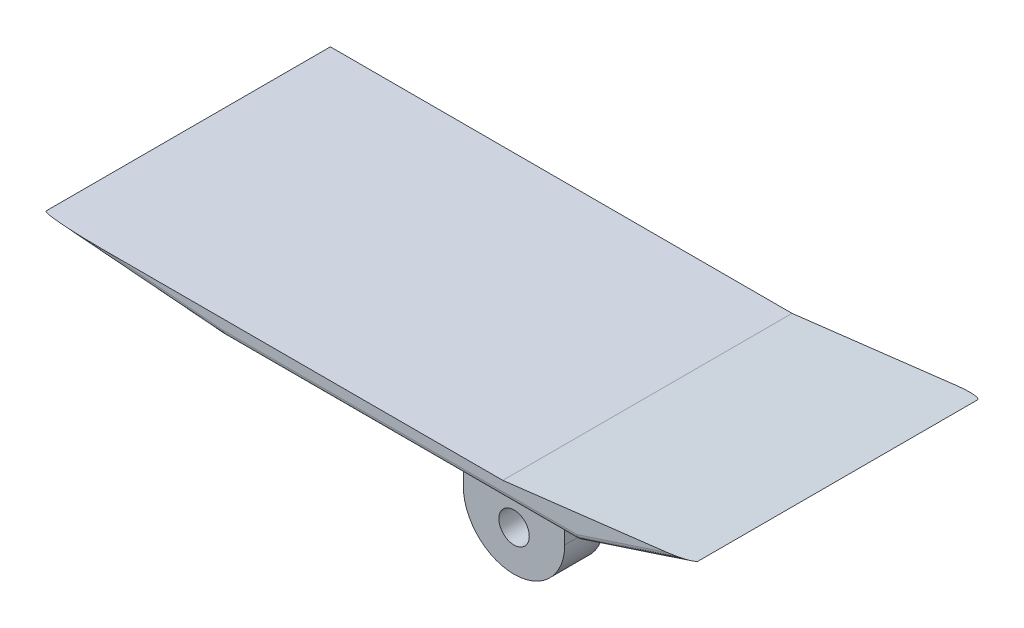
ISO-10303-21;
HEADER;
FILE_DESCRIPTION(('STEP AP214'),'2;1');
FILE_NAME('part.step','',(''),(''),'','','');
FILE_SCHEMA(('AUTOMOTIVE_DESIGN { 1 0 10303 214 1 1 1 1 }'));
ENDSEC;
DATA;
#1=APPLICATION_CONTEXT('core data for automotive mechanical design processes');
#2=APPLICATION_PROTOCOL_DEFINITION('international standard','automotive_design',2000,#1);
#3=PRODUCT_CONTEXT('',#1,'mechanical');
#4=PRODUCT('Part','Part','',(#3));
#5=PRODUCT_RELATED_PRODUCT_CATEGORY('part','',(#4));
#6=PRODUCT_DEFINITION_FORMATION('','',#4);
#7=PRODUCT_DEFINITION_CONTEXT('part definition',#1,'design');
#8=PRODUCT_DEFINITION('design','',#6,#7);
#9=PRODUCT_DEFINITION_SHAPE('','',#8);
#10=(LENGTH_UNIT() NAMED_UNIT(*) SI_UNIT(.MILLI.,.METRE.));
#11=(NAMED_UNIT(*) PLANE_ANGLE_UNIT() SI_UNIT($,.RADIAN.));
#12=(NAMED_UNIT(*) SI_UNIT($,.STERADIAN.) SOLID_ANGLE_UNIT());
#13=UNCERTAINTY_MEASURE_WITH_UNIT(LENGTH_MEASURE(1.E-05),#10,'distance_accuracy_value','');
#14=(GEOMETRIC_REPRESENTATION_CONTEXT(3) GLOBAL_UNCERTAINTY_ASSIGNED_CONTEXT((#13)) GLOBAL_UNIT_ASSIGNED_CONTEXT((#10,
#11,#12)) REPRESENTATION_CONTEXT('',''));
#15=CARTESIAN_POINT('',(0.,0.,0.));
#16=DIRECTION('',(0.,0.,1.));
#17=DIRECTION('',(1.,0.,0.));
#18=AXIS2_PLACEMENT_3D('',#15,#16,#17);
#19=CARTESIAN_POINT('',(-1500.,-1340.26701012435,-168.105566683837));
#20=DIRECTION('',(0.,-1.,0.));
#21=DIRECTION('',(0.,0.,-1.));
#22=AXIS2_PLACEMENT_3D('',#19,#20,#21);
#23=PLANE('',#22);
#24=DIRECTION('',(0.,0.,-1.));
#25=VECTOR('',#24,1.);
#26=CARTESIAN_POINT('',(1992.02807752052,-1340.26701012435,-168.105566683835));
#27=LINE('',#26,#25);
#28=CARTESIAN_POINT('',(1992.02807752052,-1340.26701012435,-118.105566683837));
#29=VERTEX_POINT('',#28);
#30=CARTESIAN_POINT('',(1992.02807752052,-1340.26701012435,2635.20722599521));
#31=VERTEX_POINT('',#30);
#32=EDGE_CURVE('E296',#29,#31,#27,.F.);
#33=ORIENTED_EDGE('',*,*,#32,.T.);
#34=DIRECTION('',(1.,0.,0.));
#35=VECTOR('',#34,1.);
#36=CARTESIAN_POINT('',(-1500.,-1340.26701012435,2635.20722599521));
#37=LINE('',#36,#35);
#38=CARTESIAN_POINT('',(-1497.95145974499,-1340.26701012435,2635.20722599521));
#39=VERTEX_POINT('',#38);
#40=EDGE_CURVE('E300',#31,#39,#37,.F.);
#41=ORIENTED_EDGE('',*,*,#40,.T.);
#42=DIRECTION('',(0.,0.,-1.));
#43=VECTOR('',#42,1.);
#44=CARTESIAN_POINT('',(-1497.951459745,-1340.26701012435,-168.105566683837));
#45=LINE('',#44,#43);
#46=CARTESIAN_POINT('',(-1497.951459745,-1340.26701012435,-118.105566683837));
#47=VERTEX_POINT('',#46);
#48=EDGE_CURVE('E298',#39,#47,#45,.T.);
#49=ORIENTED_EDGE('',*,*,#48,.T.);
#50=DIRECTION('',(1.,0.,0.));
#51=VECTOR('',#50,1.);
#52=CARTESIAN_POINT('',(-1500.,-1340.26701012435,-118.105566683837));
#53=LINE('',#52,#51);
#54=EDGE_CURVE('E294',#47,#29,#53,.T.);
#55=ORIENTED_EDGE('',*,*,#54,.T.);
#56=EDGE_LOOP('',(#33,#41,#49,#55));
#57=FACE_BOUND('',#56,.T.);
#58=DIRECTION('',(0.,0.,-1.));
#59=VECTOR('',#58,1.);
#60=CARTESIAN_POINT('',(670.760339716888,-1340.26701012435,421.894433316163));
#61=LINE('',#60,#59);
#62=CARTESIAN_POINT('',(670.760339716888,-1340.26701012435,421.894433316163));
#63=VERTEX_POINT('',#62);
#64=CARTESIAN_POINT('',(670.760339716888,-1340.26701012435,31.8944333161629));
#65=VERTEX_POINT('',#64);
#66=EDGE_CURVE('E263',#63,#65,#61,.T.);
#67=ORIENTED_EDGE('',*,*,#66,.F.);
#68=DIRECTION('',(-1.,0.,0.));
#69=VECTOR('',#68,1.);
#70=CARTESIAN_POINT('',(0.,-1340.26701012435,421.894433316163));
#71=LINE('',#70,#69);
#72=CARTESIAN_POINT('',(1670.76033971689,-1340.26701012435,421.894433316163));
#73=VERTEX_POINT('',#72);
#74=EDGE_CURVE('E246',#73,#63,#71,.T.);
#75=ORIENTED_EDGE('',*,*,#74,.F.);
#76=DIRECTION('',(0.,0.,-1.));
#77=VECTOR('',#76,1.);
#78=CARTESIAN_POINT('',(1670.76033971689,-1340.26701012435,421.894433316163));
#79=LINE('',#78,#77);
#80=CARTESIAN_POINT('',(1670.76033971689,-1340.26701012435,31.8944333161629));
#81=VERTEX_POINT('',#80);
#82=EDGE_CURVE('E180',#73,#81,#79,.T.);
#83=ORIENTED_EDGE('',*,*,#82,.T.);
#84=DIRECTION('',(-1.,0.,0.));
#85=VECTOR('',#84,1.);
#86=CARTESIAN_POINT('',(0.,-1340.26701012435,31.8944333161629));
#87=LINE('',#86,#85);
#88=EDGE_CURVE('E238',#81,#65,#87,.T.);
#89=ORIENTED_EDGE('',*,*,#88,.T.);
#90=EDGE_LOOP('',(#67,#75,#83,#89));
#91=FACE_BOUND('',#90,.T.);
#92=DIRECTION('',(0.,0.,1.));
#93=VECTOR('',#92,1.);
#94=CARTESIAN_POINT('',(1670.76033971689,-1340.26701012435,2095.20722599521));
#95=LINE('',#94,#93);
#96=CARTESIAN_POINT('',(1670.76033971689,-1340.26701012435,2095.20722599521));
#97=VERTEX_POINT('',#96);
#98=CARTESIAN_POINT('',(1670.76033971689,-1340.26701012435,2485.20722599521));
#99=VERTEX_POINT('',#98);
#100=EDGE_CURVE('E228',#97,#99,#95,.T.);
#101=ORIENTED_EDGE('',*,*,#100,.F.);
#102=DIRECTION('',(1.,0.,0.));
#103=VECTOR('',#102,1.);
#104=CARTESIAN_POINT('',(0.,-1340.26701012435,2095.20722599521));
#105=LINE('',#104,#103);
#106=CARTESIAN_POINT('',(670.760339716888,-1340.26701012435,2095.20722599521));
#107=VERTEX_POINT('',#106);
#108=EDGE_CURVE('E209',#107,#97,#105,.T.);
#109=ORIENTED_EDGE('',*,*,#108,.F.);
#110=DIRECTION('',(0.,0.,1.));
#111=VECTOR('',#110,1.);
#112=CARTESIAN_POINT('',(670.760339716888,-1340.26701012435,2095.20722599521));
#113=LINE('',#112,#111);
#114=CARTESIAN_POINT('',(670.760339716888,-1340.26701012435,2485.20722599521));
#115=VERTEX_POINT('',#114);
#116=EDGE_CURVE('E225',#107,#115,#113,.T.);
#117=ORIENTED_EDGE('',*,*,#116,.T.);
#118=DIRECTION('',(1.,0.,0.));
#119=VECTOR('',#118,1.);
#120=CARTESIAN_POINT('',(0.,-1340.26701012435,2485.20722599521));
#121=LINE('',#120,#119);
#122=EDGE_CURVE('E201',#115,#99,#121,.T.);
#123=ORIENTED_EDGE('',*,*,#122,.T.);
#124=EDGE_LOOP('',(#101,#109,#117,#123));
#125=FACE_BOUND('',#124,.T.);
#126=ADVANCED_FACE('F41',(#57,#91,#125),#23,.T.);
#127=CARTESIAN_POINT('',(-1500.,-1340.26701012435,2685.20722599521));
#128=DIRECTION('',(0.,0.,1.));
#129=DIRECTION('',(1.,0.,0.));
#130=AXIS2_PLACEMENT_3D('',#127,#128,#129);
#131=PLANE('',#130);
#132=DIRECTION('',(1.,0.,0.));
#133=VECTOR('',#132,1.);
#134=CARTESIAN_POINT('',(-1500.,-1290.26701012435,2685.20722599521));
#135=LINE('',#134,#133);
#136=CARTESIAN_POINT('',(-1497.95145974499,-1290.26701012435,2685.20722599521));
#137=VERTEX_POINT('',#136);
#138=CARTESIAN_POINT('',(1992.02807752052,-1290.26701012435,2685.20722599521));
#139=VERTEX_POINT('',#138);
#140=EDGE_CURVE('E370',#137,#139,#135,.T.);
#141=ORIENTED_EDGE('',*,*,#140,.T.);
#142=DIRECTION('',(0.950419137802848,0.310971803381098,0.));
#143=VECTOR('',#142,1.);
#144=CARTESIAN_POINT('',(-1177.08647142573,-2327.18348961082,2685.20722599521));
#145=LINE('',#144,#143);
#146=CARTESIAN_POINT('',(2885.58549254005,-997.900043045437,2685.20722599521));
#147=VERTEX_POINT('',#146);
#148=EDGE_CURVE('E283',#139,#147,#145,.T.);
#149=ORIENTED_EDGE('',*,*,#148,.T.);
#150=DIRECTION('',(-0.992876838486922,-0.119145220618431,0.));
#151=VECTOR('',#150,1.);
#152=CARTESIAN_POINT('',(3139.49376696443,-967.431050114511,2685.20722599521));
#153=LINE('',#152,#151);
#154=CARTESIAN_POINT('',(1260.,-1192.97030215024,2685.20722599521));
#155=VERTEX_POINT('',#154);
#156=EDGE_CURVE('E190',#147,#155,#153,.T.);
#157=ORIENTED_EDGE('',*,*,#156,.T.);
#158=DIRECTION('',(1.,0.,0.));
#159=VECTOR('',#158,1.);
#160=CARTESIAN_POINT('',(-1500.,-1192.97030215024,2685.20722599521));
#161=LINE('',#160,#159);
#162=CARTESIAN_POINT('',(-2683.34902289123,-1192.97030215024,2685.20722599521));
#163=VERTEX_POINT('',#162);
#164=EDGE_CURVE('E179',#163,#155,#161,.T.);
#165=ORIENTED_EDGE('',*,*,#164,.F.);
#166=DIRECTION('',(0.99664841225711,-0.0818042929520311,0.));
#167=VECTOR('',#166,1.);
#168=CARTESIAN_POINT('',(-1495.9097853524,-1290.4345895115,2685.20722599521));
#169=LINE('',#168,#167);
#170=EDGE_CURVE('E270',#163,#137,#169,.T.);
#171=ORIENTED_EDGE('',*,*,#170,.T.);
#172=EDGE_LOOP('',(#141,#149,#157,#165,#171));
#173=FACE_BOUND('',#172,.T.);
#174=ADVANCED_FACE('F374',(#173),#131,.T.);
#175=CARTESIAN_POINT('',(-1500.,-1192.97030215024,2685.20722599521));
#176=DIRECTION('',(0.,1.,0.));
#177=DIRECTION('',(0.,0.,1.));
#178=AXIS2_PLACEMENT_3D('',#175,#176,#177);
#179=PLANE('',#178);
#180=DIRECTION('',(0.,0.,1.));
#181=VECTOR('',#180,1.);
#182=CARTESIAN_POINT('',(-3294.56388944254,-1192.97030215024,-168.105574004794));
#183=LINE('',#182,#181);
#184=CARTESIAN_POINT('',(-3294.56388944254,-1192.97030215024,-168.105574004794));
#185=VERTEX_POINT('',#184);
#186=CARTESIAN_POINT('',(-3294.56388944254,-1192.97030215024,2635.20722599521));
#187=VERTEX_POINT('',#186);
#188=EDGE_CURVE('E174',#185,#187,#183,.T.);
#189=ORIENTED_EDGE('',*,*,#188,.T.);
#190=CARTESIAN_POINT('',(-2683.34902289123,-1192.97030215024,2635.20722599521));
#191=DIRECTION('',(0.,1.,0.));
#192=DIRECTION('',(1.,0.,0.));
#193=AXIS2_PLACEMENT_3D('',#190,#191,#192);
#194=ELLIPSE('',#193,611.214866551311,50.);
#195=EDGE_CURVE('E307',#187,#163,#194,.T.);
#196=ORIENTED_EDGE('',*,*,#195,.T.);
#197=ORIENTED_EDGE('',*,*,#164,.T.);
#198=DIRECTION('',(0.,0.,1.));
#199=VECTOR('',#198,1.);
#200=CARTESIAN_POINT('',(1260.,-1192.97030215024,-168.105574004794));
#201=LINE('',#200,#199);
#202=CARTESIAN_POINT('',(1259.99999999996,-1192.97030215024,-168.105566683837));
#203=VERTEX_POINT('',#202);
#204=EDGE_CURVE('E177',#203,#155,#201,.T.);
#205=ORIENTED_EDGE('',*,*,#204,.F.);
#206=DIRECTION('',(1.,0.,0.));
#207=VECTOR('',#206,1.);
#208=CARTESIAN_POINT('',(-1500.,-1192.97030215024,-168.105566683837));
#209=LINE('',#208,#207);
#210=EDGE_CURVE('E171',#185,#203,#209,.T.);
#211=ORIENTED_EDGE('',*,*,#210,.F.);
#212=EDGE_LOOP('',(#189,#196,#197,#205,#211));
#213=FACE_BOUND('',#212,.T.);
#214=ADVANCED_FACE('F173',(#213),#179,.T.);
#215=CARTESIAN_POINT('',(-1500.,-1192.97030215024,-168.105566683837));
#216=DIRECTION('',(0.,0.,-1.));
#217=DIRECTION('',(-1.,0.,0.));
#218=AXIS2_PLACEMENT_3D('',#215,#216,#217);
#219=PLANE('',#218);
#220=DIRECTION('',(-0.992876838486922,-0.119145220618431,0.));
#221=VECTOR('',#220,1.);
#222=CARTESIAN_POINT('',(3139.49376696443,-967.431050114511,-168.105574004794));
#223=LINE('',#222,#221);
#224=CARTESIAN_POINT('',(2885.58549254005,-997.900043045436,-168.105574004794));
#225=VERTEX_POINT('',#224);
#226=EDGE_CURVE('E193',#225,#203,#223,.T.);
#227=ORIENTED_EDGE('',*,*,#226,.F.);
#228=DIRECTION('',(0.950419137802848,0.310971803381098,0.));
#229=VECTOR('',#228,1.);
#230=CARTESIAN_POINT('',(-1133.55240600189,-2312.93938793515,-168.105566683837));
#231=LINE('',#230,#229);
#232=CARTESIAN_POINT('',(1992.02807752052,-1290.26701012435,-168.105566683837));
#233=VERTEX_POINT('',#232);
#234=EDGE_CURVE('E11',#225,#233,#231,.F.);
#235=ORIENTED_EDGE('',*,*,#234,.T.);
#236=DIRECTION('',(1.,0.,0.));
#237=VECTOR('',#236,1.);
#238=CARTESIAN_POINT('',(-1500.,-1290.26701012435,-168.105566683837));
#239=LINE('',#238,#237);
#240=CARTESIAN_POINT('',(-2109.16632629631,-1290.26701012435,-168.105574004794));
#241=VERTEX_POINT('',#240);
#242=EDGE_CURVE('E50',#233,#241,#239,.F.);
#243=ORIENTED_EDGE('',*,*,#242,.T.);
#244=DIRECTION('',(0.99664841225711,-0.0818042929520311,0.));
#245=VECTOR('',#244,1.);
#246=CARTESIAN_POINT('',(-3294.56388944254,-1192.97030215024,-168.105574004794));
#247=LINE('',#246,#245);
#248=EDGE_CURVE('E184',#185,#241,#247,.T.);
#249=ORIENTED_EDGE('',*,*,#248,.F.);
#250=ORIENTED_EDGE('',*,*,#210,.T.);
#251=EDGE_LOOP('',(#227,#235,#243,#249,#250));
#252=FACE_BOUND('',#251,.T.);
#253=ADVANCED_FACE('F189',(#252),#219,.T.);
#254=CARTESIAN_POINT('',(1670.76033971689,1.23661106518949E-12,421.894433316163));
#255=DIRECTION('',(1.,0.,0.));
#256=DIRECTION('',(0.,1.,0.));
#257=AXIS2_PLACEMENT_3D('',#254,#255,#256);
#258=PLANE('',#257);
#259=DIRECTION('',(0.,-1.,0.));
#260=VECTOR('',#259,1.);
#261=CARTESIAN_POINT('',(1670.76033971689,1.23661106518949E-12,31.8944333161629));
#262=LINE('',#261,#260);
#263=CARTESIAN_POINT('',(1670.76033971689,-1640.26701012435,31.8944333161629));
#264=VERTEX_POINT('',#263);
#265=EDGE_CURVE('E252',#81,#264,#262,.T.);
#266=ORIENTED_EDGE('',*,*,#265,.F.);
#267=ORIENTED_EDGE('',*,*,#82,.F.);
#268=DIRECTION('',(0.,-1.,0.));
#269=VECTOR('',#268,1.);
#270=CARTESIAN_POINT('',(1670.76033971689,1.23661106518949E-12,421.894433316163));
#271=LINE('',#270,#269);
#272=CARTESIAN_POINT('',(1670.76033971689,-1640.26701012435,421.894433316163));
#273=VERTEX_POINT('',#272);
#274=EDGE_CURVE('E237',#73,#273,#271,.T.);
#275=ORIENTED_EDGE('',*,*,#274,.T.);
#276=DIRECTION('',(0.,0.,-1.));
#277=VECTOR('',#276,1.);
#278=CARTESIAN_POINT('',(1670.76033971689,-1640.26701012435,421.894433316163));
#279=LINE('',#278,#277);
#280=EDGE_CURVE('E249',#273,#264,#279,.T.);
#281=ORIENTED_EDGE('',*,*,#280,.T.);
#282=EDGE_LOOP('',(#266,#267,#275,#281));
#283=FACE_BOUND('',#282,.T.);
#284=ADVANCED_FACE('F589',(#283),#258,.T.);
#285=CARTESIAN_POINT('',(670.760339716889,-2.48231191053027E-13,421.894433316163));
#286=DIRECTION('',(1.,0.,0.));
#287=DIRECTION('',(0.,1.,0.));
#288=AXIS2_PLACEMENT_3D('',#285,#286,#287);
#289=PLANE('',#288);
#290=DIRECTION('',(0.,-1.,0.));
#291=VECTOR('',#290,1.);
#292=CARTESIAN_POINT('',(670.760339716889,-2.48231191053027E-13,31.8944333161629));
#293=LINE('',#292,#291);
#294=CARTESIAN_POINT('',(670.760339716888,-1640.26701012435,31.8944333161629));
#295=VERTEX_POINT('',#294);
#296=EDGE_CURVE('E258',#65,#295,#293,.T.);
#297=ORIENTED_EDGE('',*,*,#296,.T.);
#298=DIRECTION('',(0.,0.,-1.));
#299=VECTOR('',#298,1.);
#300=CARTESIAN_POINT('',(670.760339716888,-1640.26701012435,421.894433316163));
#301=LINE('',#300,#299);
#302=CARTESIAN_POINT('',(670.760339716888,-1640.26701012435,421.894433316163));
#303=VERTEX_POINT('',#302);
#304=EDGE_CURVE('E266',#303,#295,#301,.T.);
#305=ORIENTED_EDGE('',*,*,#304,.F.);
#306=DIRECTION('',(0.,-1.,0.));
#307=VECTOR('',#306,1.);
#308=CARTESIAN_POINT('',(670.760339716889,-2.48231191053027E-13,421.894433316163));
#309=LINE('',#308,#307);
#310=EDGE_CURVE('E244',#63,#303,#309,.T.);
#311=ORIENTED_EDGE('',*,*,#310,.F.);
#312=ORIENTED_EDGE('',*,*,#66,.T.);
#313=EDGE_LOOP('',(#297,#305,#311,#312));
#314=FACE_BOUND('',#313,.T.);
#315=ADVANCED_FACE('F580',(#314),#289,.F.);
#316=CARTESIAN_POINT('',(1170.76033971689,-1740.26701012435,421.894433316163));
#317=DIRECTION('',(0.,0.,-1.));
#318=DIRECTION('',(-1.,0.,0.));
#319=AXIS2_PLACEMENT_3D('',#316,#317,#318);
#320=CYLINDRICAL_SURFACE('',#319,150.);
#321=CARTESIAN_POINT('',(1170.76033971689,-1740.26701012435,421.894433316163));
#322=DIRECTION('',(0.,0.,-1.));
#323=DIRECTION('',(-1.,0.,0.));
#324=AXIS2_PLACEMENT_3D('',#321,#322,#323);
#325=CIRCLE('',#324,150.);
#326=CARTESIAN_POINT('',(1020.76033971689,-1740.26701012435,421.894433316163));
#327=VERTEX_POINT('',#326);
#328=EDGE_CURVE('E234',#327,#327,#325,.T.);
#329=ORIENTED_EDGE('',*,*,#328,.F.);
#330=EDGE_LOOP('',(#329));
#331=FACE_BOUND('',#330,.T.);
#332=CARTESIAN_POINT('',(1170.76033971689,-1740.26701012435,31.8944333161629));
#333=DIRECTION('',(0.,0.,-1.));
#334=DIRECTION('',(-1.,0.,0.));
#335=AXIS2_PLACEMENT_3D('',#332,#333,#334);
#336=CIRCLE('',#335,150.);
#337=CARTESIAN_POINT('',(1020.76033971689,-1740.26701012435,31.8944333161629));
#338=VERTEX_POINT('',#337);
#339=EDGE_CURVE('E227',#338,#338,#336,.T.);
#340=ORIENTED_EDGE('',*,*,#339,.T.);
#341=EDGE_LOOP('',(#340));
#342=FACE_BOUND('',#341,.T.);
#343=ADVANCED_FACE('F571',(#331,#342),#320,.F.);
#344=CARTESIAN_POINT('',(1170.76033971689,-1640.26701012435,421.894433316163));
#345=DIRECTION('',(0.,0.,-1.));
#346=DIRECTION('',(-1.,0.,0.));
#347=AXIS2_PLACEMENT_3D('',#344,#345,#346);
#348=CYLINDRICAL_SURFACE('',#347,500.);
#349=CARTESIAN_POINT('',(1170.76033971689,-1640.26701012435,31.8944333161629));
#350=DIRECTION('',(0.,0.,-1.));
#351=DIRECTION('',(-1.,0.,0.));
#352=AXIS2_PLACEMENT_3D('',#349,#350,#351);
#353=CIRCLE('',#352,500.);
#354=EDGE_CURVE('E255',#264,#295,#353,.T.);
#355=ORIENTED_EDGE('',*,*,#354,.F.);
#356=ORIENTED_EDGE('',*,*,#280,.F.);
#357=CARTESIAN_POINT('',(1170.76033971689,-1640.26701012435,421.894433316163));
#358=DIRECTION('',(0.,0.,-1.));
#359=DIRECTION('',(-1.,0.,0.));
#360=AXIS2_PLACEMENT_3D('',#357,#358,#359);
#361=CIRCLE('',#360,500.);
#362=EDGE_CURVE('E241',#273,#303,#361,.T.);
#363=ORIENTED_EDGE('',*,*,#362,.T.);
#364=ORIENTED_EDGE('',*,*,#304,.T.);
#365=EDGE_LOOP('',(#355,#356,#363,#364));
#366=FACE_BOUND('',#365,.T.);
#367=ADVANCED_FACE('F562',(#366),#348,.T.);
#368=CARTESIAN_POINT('',(0.,0.,421.894433316163));
#369=DIRECTION('',(0.,0.,-1.));
#370=DIRECTION('',(-1.,0.,0.));
#371=AXIS2_PLACEMENT_3D('',#368,#369,#370);
#372=PLANE('',#371);
#373=ORIENTED_EDGE('',*,*,#328,.T.);
#374=EDGE_LOOP('',(#373));
#375=FACE_BOUND('',#374,.T.);
#376=ORIENTED_EDGE('',*,*,#274,.F.);
#377=ORIENTED_EDGE('',*,*,#74,.T.);
#378=ORIENTED_EDGE('',*,*,#310,.T.);
#379=ORIENTED_EDGE('',*,*,#362,.F.);
#380=EDGE_LOOP('',(#376,#377,#378,#379));
#381=FACE_BOUND('',#380,.T.);
#382=ADVANCED_FACE('F553',(#375,#381),#372,.F.);
#383=CARTESIAN_POINT('',(0.,0.,31.8944333161629));
#384=DIRECTION('',(0.,0.,-1.));
#385=DIRECTION('',(-1.,0.,0.));
#386=AXIS2_PLACEMENT_3D('',#383,#384,#385);
#387=PLANE('',#386);
#388=ORIENTED_EDGE('',*,*,#339,.F.);
#389=EDGE_LOOP('',(#388));
#390=FACE_BOUND('',#389,.T.);
#391=ORIENTED_EDGE('',*,*,#265,.T.);
#392=ORIENTED_EDGE('',*,*,#354,.T.);
#393=ORIENTED_EDGE('',*,*,#296,.F.);
#394=ORIENTED_EDGE('',*,*,#88,.F.);
#395=EDGE_LOOP('',(#391,#392,#393,#394));
#396=FACE_BOUND('',#395,.T.);
#397=ADVANCED_FACE('F540',(#390,#396),#387,.T.);
#398=CARTESIAN_POINT('',(670.76033971689,-7.44693573159083E-13,2095.20722599521));
#399=DIRECTION('',(1.,0.,0.));
#400=DIRECTION('',(0.,1.,0.));
#401=AXIS2_PLACEMENT_3D('',#398,#399,#400);
#402=PLANE('',#401);
#403=DIRECTION('',(0.,1.,0.));
#404=VECTOR('',#403,1.);
#405=CARTESIAN_POINT('',(670.76033971689,-7.44693573159083E-13,2485.20722599521));
#406=LINE('',#405,#404);
#407=CARTESIAN_POINT('',(670.760339716888,-1640.26701012435,2485.20722599521));
#408=VERTEX_POINT('',#407);
#409=EDGE_CURVE('E215',#408,#115,#406,.T.);
#410=ORIENTED_EDGE('',*,*,#409,.T.);
#411=ORIENTED_EDGE('',*,*,#116,.F.);
#412=DIRECTION('',(0.,1.,0.));
#413=VECTOR('',#412,1.);
#414=CARTESIAN_POINT('',(670.76033971689,-7.44693573159083E-13,2095.20722599521));
#415=LINE('',#414,#413);
#416=CARTESIAN_POINT('',(670.760339716888,-1640.26701012435,2095.20722599521));
#417=VERTEX_POINT('',#416);
#418=EDGE_CURVE('E200',#417,#107,#415,.T.);
#419=ORIENTED_EDGE('',*,*,#418,.F.);
#420=DIRECTION('',(0.,0.,1.));
#421=VECTOR('',#420,1.);
#422=CARTESIAN_POINT('',(670.760339716888,-1640.26701012435,2095.20722599521));
#423=LINE('',#422,#421);
#424=EDGE_CURVE('E212',#417,#408,#423,.T.);
#425=ORIENTED_EDGE('',*,*,#424,.T.);
#426=EDGE_LOOP('',(#410,#411,#419,#425));
#427=FACE_BOUND('',#426,.T.);
#428=ADVANCED_FACE('F531',(#427),#402,.F.);
#429=CARTESIAN_POINT('',(1670.76033971689,2.47322213037898E-12,2095.20722599521));
#430=DIRECTION('',(-1.,0.,0.));
#431=DIRECTION('',(0.,-1.,0.));
#432=AXIS2_PLACEMENT_3D('',#429,#430,#431);
#433=PLANE('',#432);
#434=DIRECTION('',(0.,-1.,0.));
#435=VECTOR('',#434,1.);
#436=CARTESIAN_POINT('',(1670.76033971689,2.47322213037898E-12,2485.20722599521));
#437=LINE('',#436,#435);
#438=CARTESIAN_POINT('',(1670.76033971689,-1640.26701012435,2485.20722599521));
#439=VERTEX_POINT('',#438);
#440=EDGE_CURVE('E221',#99,#439,#437,.T.);
#441=ORIENTED_EDGE('',*,*,#440,.T.);
#442=DIRECTION('',(0.,0.,1.));
#443=VECTOR('',#442,1.);
#444=CARTESIAN_POINT('',(1670.76033971689,-1640.26701012435,2095.20722599521));
#445=LINE('',#444,#443);
#446=CARTESIAN_POINT('',(1670.76033971689,-1640.26701012435,2095.20722599521));
#447=VERTEX_POINT('',#446);
#448=EDGE_CURVE('E231',#447,#439,#445,.T.);
#449=ORIENTED_EDGE('',*,*,#448,.F.);
#450=DIRECTION('',(0.,-1.,0.));
#451=VECTOR('',#450,1.);
#452=CARTESIAN_POINT('',(1670.76033971689,2.47322213037898E-12,2095.20722599521));
#453=LINE('',#452,#451);
#454=EDGE_CURVE('E207',#97,#447,#453,.T.);
#455=ORIENTED_EDGE('',*,*,#454,.F.);
#456=ORIENTED_EDGE('',*,*,#100,.T.);
#457=EDGE_LOOP('',(#441,#449,#455,#456));
#458=FACE_BOUND('',#457,.T.);
#459=ADVANCED_FACE('F522',(#458),#433,.F.);
#460=CARTESIAN_POINT('',(1170.76033971689,-1740.26701012435,2095.20722599521));
#461=DIRECTION('',(0.,0.,1.));
#462=DIRECTION('',(1.,0.,0.));
#463=AXIS2_PLACEMENT_3D('',#460,#461,#462);
#464=CYLINDRICAL_SURFACE('',#463,150.);
#465=CARTESIAN_POINT('',(1170.76033971689,-1740.26701012435,2095.20722599521));
#466=DIRECTION('',(0.,0.,1.));
#467=DIRECTION('',(1.,0.,0.));
#468=AXIS2_PLACEMENT_3D('',#465,#466,#467);
#469=CIRCLE('',#468,150.);
#470=CARTESIAN_POINT('',(1320.76033971689,-1740.26701012435,2095.20722599521));
#471=VERTEX_POINT('',#470);
#472=EDGE_CURVE('E197',#471,#471,#469,.T.);
#473=ORIENTED_EDGE('',*,*,#472,.F.);
#474=EDGE_LOOP('',(#473));
#475=FACE_BOUND('',#474,.T.);
#476=CARTESIAN_POINT('',(1170.76033971689,-1740.26701012435,2485.20722599521));
#477=DIRECTION('',(0.,0.,1.));
#478=DIRECTION('',(1.,0.,0.));
#479=AXIS2_PLACEMENT_3D('',#476,#477,#478);
#480=CIRCLE('',#479,150.);
#481=CARTESIAN_POINT('',(1320.76033971689,-1740.26701012435,2485.20722599521));
#482=VERTEX_POINT('',#481);
#483=EDGE_CURVE('E187',#482,#482,#480,.T.);
#484=ORIENTED_EDGE('',*,*,#483,.T.);
#485=EDGE_LOOP('',(#484));
#486=FACE_BOUND('',#485,.T.);
#487=ADVANCED_FACE('F513',(#475,#486),#464,.F.);
#488=CARTESIAN_POINT('',(1170.76033971689,-1640.26701012435,2095.20722599521));
#489=DIRECTION('',(0.,0.,1.));
#490=DIRECTION('',(1.,0.,0.));
#491=AXIS2_PLACEMENT_3D('',#488,#489,#490);
#492=CYLINDRICAL_SURFACE('',#491,500.);
#493=CARTESIAN_POINT('',(1170.76033971689,-1640.26701012435,2485.20722599521));
#494=DIRECTION('',(0.,0.,1.));
#495=DIRECTION('',(1.,0.,0.));
#496=AXIS2_PLACEMENT_3D('',#493,#494,#495);
#497=CIRCLE('',#496,500.);
#498=EDGE_CURVE('E218',#408,#439,#497,.T.);
#499=ORIENTED_EDGE('',*,*,#498,.F.);
#500=ORIENTED_EDGE('',*,*,#424,.F.);
#501=CARTESIAN_POINT('',(1170.76033971689,-1640.26701012435,2095.20722599521));
#502=DIRECTION('',(0.,0.,1.));
#503=DIRECTION('',(1.,0.,0.));
#504=AXIS2_PLACEMENT_3D('',#501,#502,#503);
#505=CIRCLE('',#504,500.);
#506=EDGE_CURVE('E204',#417,#447,#505,.T.);
#507=ORIENTED_EDGE('',*,*,#506,.T.);
#508=ORIENTED_EDGE('',*,*,#448,.T.);
#509=EDGE_LOOP('',(#499,#500,#507,#508));
#510=FACE_BOUND('',#509,.T.);
#511=ADVANCED_FACE('F504',(#510),#492,.T.);
#512=CARTESIAN_POINT('',(0.,0.,2095.20722599521));
#513=DIRECTION('',(0.,0.,1.));
#514=DIRECTION('',(1.,0.,0.));
#515=AXIS2_PLACEMENT_3D('',#512,#513,#514);
#516=PLANE('',#515);
#517=ORIENTED_EDGE('',*,*,#472,.T.);
#518=EDGE_LOOP('',(#517));
#519=FACE_BOUND('',#518,.T.);
#520=ORIENTED_EDGE('',*,*,#418,.T.);
#521=ORIENTED_EDGE('',*,*,#108,.T.);
#522=ORIENTED_EDGE('',*,*,#454,.T.);
#523=ORIENTED_EDGE('',*,*,#506,.F.);
#524=EDGE_LOOP('',(#520,#521,#522,#523));
#525=FACE_BOUND('',#524,.T.);
#526=ADVANCED_FACE('F494',(#519,#525),#516,.F.);
#527=CARTESIAN_POINT('',(0.,0.,2485.20722599521));
#528=DIRECTION('',(0.,0.,1.));
#529=DIRECTION('',(1.,0.,0.));
#530=AXIS2_PLACEMENT_3D('',#527,#528,#529);
#531=PLANE('',#530);
#532=ORIENTED_EDGE('',*,*,#483,.F.);
#533=EDGE_LOOP('',(#532));
#534=FACE_BOUND('',#533,.T.);
#535=ORIENTED_EDGE('',*,*,#409,.F.);
#536=ORIENTED_EDGE('',*,*,#498,.T.);
#537=ORIENTED_EDGE('',*,*,#440,.F.);
#538=ORIENTED_EDGE('',*,*,#122,.F.);
#539=EDGE_LOOP('',(#535,#536,#537,#538));
#540=FACE_BOUND('',#539,.T.);
#541=ADVANCED_FACE('F486',(#534,#540),#531,.T.);
#542=CARTESIAN_POINT('',(-3294.56388944254,-1192.97030215024,-168.105574004794));
#543=DIRECTION('',(-0.0818042929520311,-0.99664841225711,0.));
#544=DIRECTION('',(0.99664841225711,-0.0818042929520311,0.));
#545=AXIS2_PLACEMENT_3D('',#542,#543,#544);
#546=PLANE('',#545);
#547=DIRECTION('',(0.,0.,-1.));
#548=VECTOR('',#547,1.);
#549=CARTESIAN_POINT('',(-1502.0416743926,-1340.09943073721,-168.105574004797));
#550=LINE('',#549,#548);
#551=CARTESIAN_POINT('',(-1502.0416743926,-1340.09943073721,-122.195781331438));
#552=VERTEX_POINT('',#551);
#553=CARTESIAN_POINT('',(-1502.0416743926,-1340.09943073721,2635.20722599521));
#554=VERTEX_POINT('',#553);
#555=EDGE_CURVE('E64',#552,#554,#550,.F.);
#556=ORIENTED_EDGE('',*,*,#555,.T.);
#557=DIRECTION('',(0.99664841225711,-0.0818042929520311,0.));
#558=VECTOR('',#557,1.);
#559=CARTESIAN_POINT('',(-3294.56388944254,-1192.97030215024,2635.20722599521));
#560=LINE('',#559,#558);
#561=EDGE_CURVE('E186',#554,#187,#560,.F.);
#562=ORIENTED_EDGE('',*,*,#561,.T.);
#563=ORIENTED_EDGE('',*,*,#188,.F.);
#564=ORIENTED_EDGE('',*,*,#248,.T.);
#565=CARTESIAN_POINT('',(-2109.16632629631,-1290.26701012435,-118.105566683837));
#566=DIRECTION('',(-0.0818042929520311,-0.99664841225711,0.));
#567=DIRECTION('',(0.99664841225711,-0.0818042929520311,0.));
#568=AXIS2_PLACEMENT_3D('',#565,#566,#567);
#569=ELLIPSE('',#568,611.214866551311,50.);
#570=EDGE_CURVE('E303',#241,#552,#569,.T.);
#571=ORIENTED_EDGE('',*,*,#570,.T.);
#572=EDGE_LOOP('',(#556,#562,#563,#564,#571));
#573=FACE_BOUND('',#572,.T.);
#574=ADVANCED_FACE('F183',(#573),#546,.T.);
#575=CARTESIAN_POINT('',(3139.49376696443,-967.431050114511,-168.105574004794));
#576=DIRECTION('',(-0.119145220618431,0.992876838486922,0.));
#577=DIRECTION('',(-0.992876838486922,-0.119145220618431,0.));
#578=AXIS2_PLACEMENT_3D('',#575,#576,#577);
#579=PLANE('',#578);
#580=ORIENTED_EDGE('',*,*,#156,.F.);
#581=CARTESIAN_POINT('',(2885.58549254005,-997.900043045436,2635.20722599521));
#582=DIRECTION('',(-0.119145220618431,0.992876838486922,0.));
#583=DIRECTION('',(0.992876838486922,0.119145220618431,0.));
#584=AXIS2_PLACEMENT_3D('',#581,#582,#583);
#585=ELLIPSE('',#584,255.729879660921,50.);
#586=CARTESIAN_POINT('',(3139.49376696443,-967.431050114511,2635.20722599521));
#587=VERTEX_POINT('',#586);
#588=EDGE_CURVE('E286',#147,#587,#585,.T.);
#589=ORIENTED_EDGE('',*,*,#588,.T.);
#590=DIRECTION('',(0.,0.,1.));
#591=VECTOR('',#590,1.);
#592=CARTESIAN_POINT('',(3139.49376696443,-967.431050114511,-168.105574004794));
#593=LINE('',#592,#591);
#594=CARTESIAN_POINT('',(3139.49376696443,-967.431050114511,-118.105566683837));
#595=VERTEX_POINT('',#594);
#596=EDGE_CURVE('E274',#595,#587,#593,.T.);
#597=ORIENTED_EDGE('',*,*,#596,.F.);
#598=CARTESIAN_POINT('',(2885.58549254005,-997.900043045436,-118.105566683837));
#599=DIRECTION('',(-0.119145220618431,0.992876838486922,0.));
#600=DIRECTION('',(0.992876838486922,0.119145220618431,0.));
#601=AXIS2_PLACEMENT_3D('',#598,#599,#600);
#602=ELLIPSE('',#601,255.729879660921,50.);
#603=EDGE_CURVE('E284',#595,#225,#602,.T.);
#604=ORIENTED_EDGE('',*,*,#603,.T.);
#605=ORIENTED_EDGE('',*,*,#226,.T.);
#606=ORIENTED_EDGE('',*,*,#204,.T.);
#607=EDGE_LOOP('',(#580,#589,#597,#604,#605,#606));
#608=FACE_BOUND('',#607,.T.);
#609=ADVANCED_FACE('F469',(#608),#579,.T.);
#610=CARTESIAN_POINT('',(2000.,-1340.26701012435,-168.105574004794));
#611=DIRECTION('',(0.310971803381098,-0.950419137802848,0.));
#612=DIRECTION('',(0.950419137802848,0.310971803381098,0.));
#613=AXIS2_PLACEMENT_3D('',#610,#611,#612);
#614=PLANE('',#613);
#615=ORIENTED_EDGE('',*,*,#596,.T.);
#616=DIRECTION('',(0.950419137802848,0.310971803381098,0.));
#617=VECTOR('',#616,1.);
#618=CARTESIAN_POINT('',(2000.,-1340.26701012435,2635.20722599521));
#619=LINE('',#618,#617);
#620=CARTESIAN_POINT('',(2007.57666768958,-1337.78796701449,2635.20722599521));
#621=VERTEX_POINT('',#620);
#622=EDGE_CURVE('E292',#587,#621,#619,.F.);
#623=ORIENTED_EDGE('',*,*,#622,.T.);
#624=DIRECTION('',(0.,0.,-1.));
#625=VECTOR('',#624,1.);
#626=CARTESIAN_POINT('',(2007.57666768958,-1337.78796701449,-168.105574004794));
#627=LINE('',#626,#625);
#628=CARTESIAN_POINT('',(2007.57666768958,-1337.78796701449,-118.105566683837));
#629=VERTEX_POINT('',#628);
#630=EDGE_CURVE('E290',#621,#629,#627,.T.);
#631=ORIENTED_EDGE('',*,*,#630,.T.);
#632=DIRECTION('',(0.950419137802848,0.310971803381098,0.));
#633=VECTOR('',#632,1.);
#634=CARTESIAN_POINT('',(2000.,-1340.26701012435,-118.105566683837));
#635=LINE('',#634,#633);
#636=EDGE_CURVE('E288',#629,#595,#635,.T.);
#637=ORIENTED_EDGE('',*,*,#636,.T.);
#638=EDGE_LOOP('',(#615,#623,#631,#637));
#639=FACE_BOUND('',#638,.T.);
#640=ADVANCED_FACE('F461',(#639),#614,.T.);
#641=CARTESIAN_POINT('',(1984.45140983095,-1292.74605323421,-118.105566683837));
#642=DIRECTION('',(0.950419137802848,0.310971803381098,0.));
#643=DIRECTION('',(-0.310971803381098,0.950419137802848,0.));
#644=AXIS2_PLACEMENT_3D('',#641,#642,#643);
#645=CYLINDRICAL_SURFACE('',#644,50.);
#646=ORIENTED_EDGE('',*,*,#603,.F.);
#647=ORIENTED_EDGE('',*,*,#636,.F.);
#648=CARTESIAN_POINT('',(1992.02807752052,-1290.26701012435,-118.105566683837));
#649=DIRECTION('',(-0.950419137802847,-0.310971803381101,0.));
#650=DIRECTION('',(0.310971803381101,-0.950419137802847,0.));
#651=AXIS2_PLACEMENT_3D('',#648,#649,#650);
#652=CIRCLE('',#651,50.);
#653=EDGE_CURVE('E332',#233,#629,#652,.T.);
#654=ORIENTED_EDGE('',*,*,#653,.F.);
#655=ORIENTED_EDGE('',*,*,#234,.F.);
#656=EDGE_LOOP('',(#646,#647,#654,#655));
#657=FACE_BOUND('',#656,.T.);
#658=ADVANCED_FACE('F43',(#657),#645,.T.);
#659=CARTESIAN_POINT('',(-1500.,-1290.26701012435,-118.105566683837));
#660=DIRECTION('',(1.,0.,0.));
#661=DIRECTION('',(0.,0.,-1.));
#662=AXIS2_PLACEMENT_3D('',#659,#660,#661);
#663=CYLINDRICAL_SURFACE('',#662,50.);
#664=CARTESIAN_POINT('',(1992.02807752052,-1290.26701012435,-118.105566683837));
#665=DIRECTION('',(1.,0.,0.));
#666=DIRECTION('',(0.,0.,-1.));
#667=AXIS2_PLACEMENT_3D('',#664,#665,#666);
#668=CIRCLE('',#667,50.);
#669=EDGE_CURVE('E330',#29,#233,#668,.T.);
#670=ORIENTED_EDGE('',*,*,#669,.F.);
#671=ORIENTED_EDGE('',*,*,#54,.F.);
#672=CARTESIAN_POINT('',(-1497.951459745,-1290.26701012435,-118.105566683837));
#673=DIRECTION('',(0.707106781186547,0.,-0.707106781186548));
#674=DIRECTION('',(0.707106781186548,0.,0.707106781186547));
#675=AXIS2_PLACEMENT_3D('',#672,#673,#674);
#676=ELLIPSE('',#675,70.7106781186548,50.);
#677=EDGE_CURVE('E45',#552,#47,#676,.F.);
#678=ORIENTED_EDGE('',*,*,#677,.F.);
#679=ORIENTED_EDGE('',*,*,#570,.F.);
#680=ORIENTED_EDGE('',*,*,#242,.F.);
#681=EDGE_LOOP('',(#670,#671,#678,#679,#680));
#682=FACE_BOUND('',#681,.T.);
#683=ADVANCED_FACE('F346',(#682),#663,.T.);
#684=CARTESIAN_POINT('',(-1497.951459745,-1290.26701012435,-168.105566683837));
#685=DIRECTION('',(0.,0.,-1.));
#686=DIRECTION('',(-1.,0.,0.));
#687=AXIS2_PLACEMENT_3D('',#684,#685,#686);
#688=CYLINDRICAL_SURFACE('',#687,50.);
#689=ORIENTED_EDGE('',*,*,#677,.T.);
#690=ORIENTED_EDGE('',*,*,#48,.F.);
#691=CARTESIAN_POINT('',(-1497.95145974499,-1290.26701012435,2635.20722599521));
#692=DIRECTION('',(0.,0.,1.));
#693=DIRECTION('',(1.,0.,0.));
#694=AXIS2_PLACEMENT_3D('',#691,#692,#693);
#695=CIRCLE('',#694,50.);
#696=EDGE_CURVE('E327',#554,#39,#695,.T.);
#697=ORIENTED_EDGE('',*,*,#696,.F.);
#698=ORIENTED_EDGE('',*,*,#555,.F.);
#699=EDGE_LOOP('',(#689,#690,#697,#698));
#700=FACE_BOUND('',#699,.T.);
#701=ADVANCED_FACE('F341',(#700),#688,.T.);
#702=CARTESIAN_POINT('',(-1495.9097853524,-1290.4345895115,2635.20722599521));
#703=DIRECTION('',(0.99664841225711,-0.0818042929520311,0.));
#704=DIRECTION('',(0.0818042929520311,0.99664841225711,0.));
#705=AXIS2_PLACEMENT_3D('',#702,#703,#704);
#706=CYLINDRICAL_SURFACE('',#705,50.);
#707=ORIENTED_EDGE('',*,*,#195,.F.);
#708=ORIENTED_EDGE('',*,*,#561,.F.);
#709=CARTESIAN_POINT('',(-1497.95145974499,-1290.26701012435,2635.20722599521));
#710=DIRECTION('',(0.996648412257109,-0.0818042929520367,0.));
#711=DIRECTION('',(0.0818042929520368,0.99664841225711,0.));
#712=AXIS2_PLACEMENT_3D('',#709,#710,#711);
#713=CIRCLE('',#712,50.);
#714=EDGE_CURVE('E324',#137,#554,#713,.T.);
#715=ORIENTED_EDGE('',*,*,#714,.F.);
#716=ORIENTED_EDGE('',*,*,#170,.F.);
#717=EDGE_LOOP('',(#707,#708,#715,#716));
#718=FACE_BOUND('',#717,.T.);
#719=ADVANCED_FACE('F376',(#718),#706,.T.);
#720=CARTESIAN_POINT('',(1992.02807752052,-1290.26701012435,-118.105566683837));
#721=DIRECTION('',(0.,0.,-1.));
#722=DIRECTION('',(-1.,0.,0.));
#723=AXIS2_PLACEMENT_3D('',#720,#721,#722);
#724=SPHERICAL_SURFACE('',#723,50.);
#725=ORIENTED_EDGE('',*,*,#669,.T.);
#726=ORIENTED_EDGE('',*,*,#653,.T.);
#727=CARTESIAN_POINT('',(1992.02807752052,-1290.26701012435,-118.105566683837));
#728=DIRECTION('',(0.,0.,-1.));
#729=DIRECTION('',(-1.,0.,0.));
#730=AXIS2_PLACEMENT_3D('',#727,#728,#729);
#731=CIRCLE('',#730,50.);
#732=EDGE_CURVE('E321',#29,#629,#731,.F.);
#733=ORIENTED_EDGE('',*,*,#732,.F.);
#734=EDGE_LOOP('',(#725,#726,#733));
#735=FACE_BOUND('',#734,.T.);
#736=ADVANCED_FACE('F380',(#735),#724,.T.);
#737=CARTESIAN_POINT('',(-1497.95145974499,-1290.26701012435,2635.20722599521));
#738=DIRECTION('',(0.,0.,1.));
#739=DIRECTION('',(1.,0.,0.));
#740=AXIS2_PLACEMENT_3D('',#737,#738,#739);
#741=SPHERICAL_SURFACE('',#740,50.);
#742=ORIENTED_EDGE('',*,*,#714,.T.);
#743=ORIENTED_EDGE('',*,*,#696,.T.);
#744=CARTESIAN_POINT('',(-1497.95145974499,-1290.26701012435,2635.20722599521));
#745=DIRECTION('',(-1.,0.,0.));
#746=DIRECTION('',(0.,0.,1.));
#747=AXIS2_PLACEMENT_3D('',#744,#745,#746);
#748=CIRCLE('',#747,50.);
#749=EDGE_CURVE('E319',#137,#39,#748,.F.);
#750=ORIENTED_EDGE('',*,*,#749,.F.);
#751=EDGE_LOOP('',(#742,#743,#750));
#752=FACE_BOUND('',#751,.T.);
#753=ADVANCED_FACE('F378',(#752),#741,.T.);
#754=CARTESIAN_POINT('',(1992.02807752052,-1290.26701012435,-168.105574004794));
#755=DIRECTION('',(0.,0.,-1.));
#756=DIRECTION('',(-1.,0.,0.));
#757=AXIS2_PLACEMENT_3D('',#754,#755,#756);
#758=CYLINDRICAL_SURFACE('',#757,50.);
#759=ORIENTED_EDGE('',*,*,#732,.T.);
#760=ORIENTED_EDGE('',*,*,#630,.F.);
#761=CARTESIAN_POINT('',(1992.02807752052,-1290.26701012435,2635.20722599521));
#762=DIRECTION('',(0.,0.,1.));
#763=DIRECTION('',(1.,0.,0.));
#764=AXIS2_PLACEMENT_3D('',#761,#762,#763);
#765=CIRCLE('',#764,50.);
#766=EDGE_CURVE('E316',#31,#621,#765,.T.);
#767=ORIENTED_EDGE('',*,*,#766,.F.);
#768=ORIENTED_EDGE('',*,*,#32,.F.);
#769=EDGE_LOOP('',(#759,#760,#767,#768));
#770=FACE_BOUND('',#769,.T.);
#771=ADVANCED_FACE('F360',(#770),#758,.T.);
#772=CARTESIAN_POINT('',(-1500.,-1290.26701012435,2635.20722599521));
#773=DIRECTION('',(1.,0.,0.));
#774=DIRECTION('',(0.,0.,-1.));
#775=AXIS2_PLACEMENT_3D('',#772,#773,#774);
#776=CYLINDRICAL_SURFACE('',#775,50.);
#777=ORIENTED_EDGE('',*,*,#749,.T.);
#778=ORIENTED_EDGE('',*,*,#40,.F.);
#779=CARTESIAN_POINT('',(1992.02807752052,-1290.26701012435,2635.20722599521));
#780=DIRECTION('',(1.,0.,0.));
#781=DIRECTION('',(0.,1.,0.));
#782=AXIS2_PLACEMENT_3D('',#779,#780,#781);
#783=CIRCLE('',#782,50.);
#784=EDGE_CURVE('E313',#139,#31,#783,.T.);
#785=ORIENTED_EDGE('',*,*,#784,.F.);
#786=ORIENTED_EDGE('',*,*,#140,.F.);
#787=EDGE_LOOP('',(#777,#778,#785,#786));
#788=FACE_BOUND('',#787,.T.);
#789=ADVANCED_FACE('F354',(#788),#776,.T.);
#790=CARTESIAN_POINT('',(1992.02807752052,-1290.26701012435,2635.20722599521));
#791=DIRECTION('',(0.,0.,1.));
#792=DIRECTION('',(1.,0.,0.));
#793=AXIS2_PLACEMENT_3D('',#790,#791,#792);
#794=SPHERICAL_SURFACE('',#793,50.);
#795=ORIENTED_EDGE('',*,*,#784,.T.);
#796=ORIENTED_EDGE('',*,*,#766,.T.);
#797=CARTESIAN_POINT('',(1992.02807752052,-1290.26701012435,2635.20722599521));
#798=DIRECTION('',(-0.950419137802848,-0.310971803381097,0.));
#799=DIRECTION('',(0.310971803381097,-0.950419137802848,0.));
#800=AXIS2_PLACEMENT_3D('',#797,#798,#799);
#801=CIRCLE('',#800,50.);
#802=EDGE_CURVE('E310',#139,#621,#801,.F.);
#803=ORIENTED_EDGE('',*,*,#802,.F.);
#804=EDGE_LOOP('',(#795,#796,#803));
#805=FACE_BOUND('',#804,.T.);
#806=ADVANCED_FACE('F362',(#805),#794,.T.);
#807=CARTESIAN_POINT('',(-1177.08647142573,-2327.18348961082,2635.20722599521));
#808=DIRECTION('',(0.950419137802848,0.310971803381098,0.));
#809=DIRECTION('',(-0.310971803381098,0.950419137802848,0.));
#810=AXIS2_PLACEMENT_3D('',#807,#808,#809);
#811=CYLINDRICAL_SURFACE('',#810,50.);
#812=ORIENTED_EDGE('',*,*,#802,.T.);
#813=ORIENTED_EDGE('',*,*,#622,.F.);
#814=ORIENTED_EDGE('',*,*,#588,.F.);
#815=ORIENTED_EDGE('',*,*,#148,.F.);
#816=EDGE_LOOP('',(#812,#813,#814,#815));
#817=FACE_BOUND('',#816,.T.);
#818=ADVANCED_FACE('F367',(#817),#811,.T.);
#819=CLOSED_SHELL('',(#126,#174,#214,#253,#284,#315,#343,#367,#382,#397,#428,#459,#487,#511,
#526,#541,#574,#609,#640,#658,#683,#701,#719,#736,#753,#771,#789,#806,#818));
#820=MANIFOLD_SOLID_BREP('B2',#819);
#821=ADVANCED_BREP_SHAPE_REPRESENTATION('',(#18,#820),#14);
#822=SHAPE_DEFINITION_REPRESENTATION(#9,#821);
ENDSEC;
END-ISO-10303-21;
